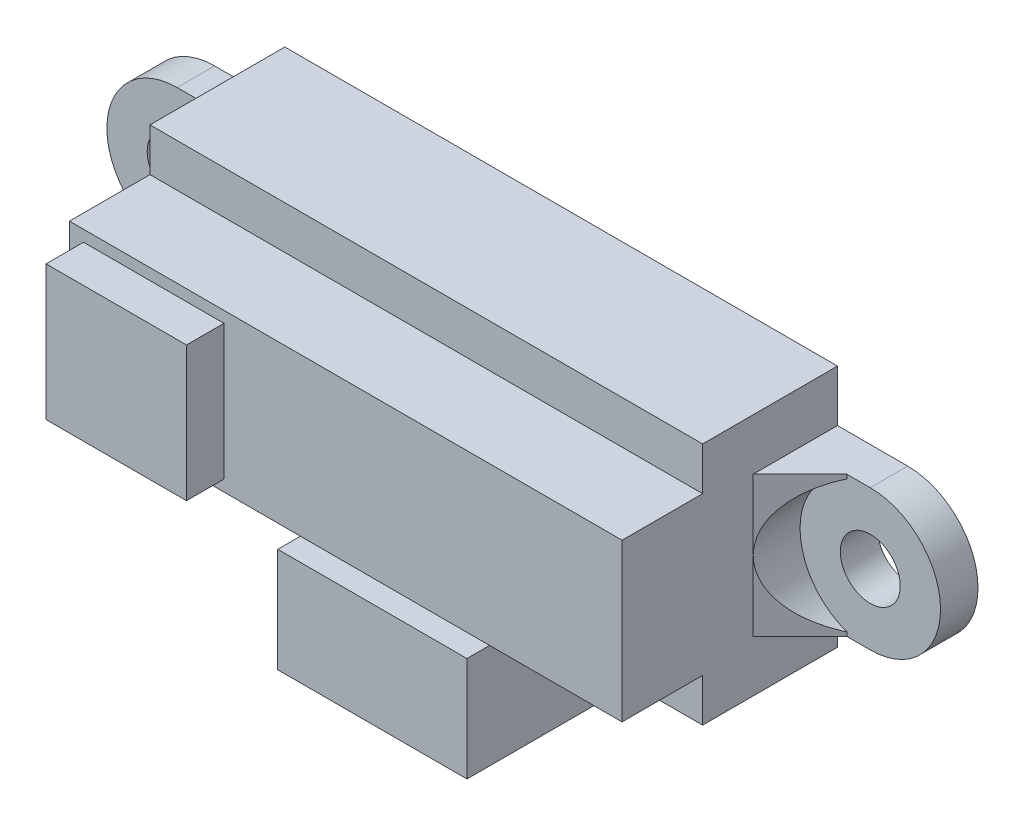
ISO-10303-21;
HEADER;
FILE_DESCRIPTION(('STEP AP214'),'2;1');
FILE_NAME('part.step','',(''),(''),'','','');
FILE_SCHEMA(('AUTOMOTIVE_DESIGN { 1 0 10303 214 1 1 1 1 }'));
ENDSEC;
DATA;
#1=APPLICATION_CONTEXT('core data for automotive mechanical design processes');
#2=APPLICATION_PROTOCOL_DEFINITION('international standard','automotive_design',2000,#1);
#3=PRODUCT_CONTEXT('',#1,'mechanical');
#4=PRODUCT('Part','Part','',(#3));
#5=PRODUCT_RELATED_PRODUCT_CATEGORY('part','',(#4));
#6=PRODUCT_DEFINITION_FORMATION('','',#4);
#7=PRODUCT_DEFINITION_CONTEXT('part definition',#1,'design');
#8=PRODUCT_DEFINITION('design','',#6,#7);
#9=PRODUCT_DEFINITION_SHAPE('','',#8);
#10=(LENGTH_UNIT() NAMED_UNIT(*) SI_UNIT(.MILLI.,.METRE.));
#11=(NAMED_UNIT(*) PLANE_ANGLE_UNIT() SI_UNIT($,.RADIAN.));
#12=(NAMED_UNIT(*) SI_UNIT($,.STERADIAN.) SOLID_ANGLE_UNIT());
#13=UNCERTAINTY_MEASURE_WITH_UNIT(LENGTH_MEASURE(1.E-05),#10,'distance_accuracy_value','');
#14=(GEOMETRIC_REPRESENTATION_CONTEXT(3) GLOBAL_UNCERTAINTY_ASSIGNED_CONTEXT((#13)) GLOBAL_UNIT_ASSIGNED_CONTEXT((#10,
#11,#12)) REPRESENTATION_CONTEXT('',''));
#15=CARTESIAN_POINT('',(0.,0.,0.));
#16=DIRECTION('',(0.,0.,1.));
#17=DIRECTION('',(1.,0.,0.));
#18=AXIS2_PLACEMENT_3D('',#15,#16,#17);
#19=CARTESIAN_POINT('',(14.75,-7.28553390593274,4.5));
#20=DIRECTION('',(0.707106781186548,0.,0.707106781186547));
#21=DIRECTION('',(0.707106781186547,0.,-0.707106781186548));
#22=AXIS2_PLACEMENT_3D('',#19,#20,#21);
#23=PLANE('',#22);
#24=CARTESIAN_POINT('',(18.5,0.,0.749999999999997));
#25=DIRECTION('',(0.707106781186548,0.,0.707106781186547));
#26=DIRECTION('',(-0.707106781186547,0.,0.707106781186548));
#27=AXIS2_PLACEMENT_3D('',#24,#25,#26);
#28=ELLIPSE('',#27,5.30330085889911,3.75);
#29=CARTESIAN_POINT('',(14.75,0.,4.5));
#30=VERTEX_POINT('',#29);
#31=CARTESIAN_POINT('',(17.25,-3.53553390593274,2.));
#32=VERTEX_POINT('',#31);
#33=EDGE_CURVE('E11',#30,#32,#28,.T.);
#34=ORIENTED_EDGE('',*,*,#33,.F.);
#35=DIRECTION('',(0.,1.,0.));
#36=VECTOR('',#35,1.);
#37=CARTESIAN_POINT('',(14.75,-7.28553390593274,4.5));
#38=LINE('',#37,#36);
#39=CARTESIAN_POINT('',(14.75,-3.75,4.5));
#40=VERTEX_POINT('',#39);
#41=EDGE_CURVE('E279',#40,#30,#38,.T.);
#42=ORIENTED_EDGE('',*,*,#41,.F.);
#43=DIRECTION('',(0.707106781186547,0.,-0.707106781186548));
#44=VECTOR('',#43,1.);
#45=CARTESIAN_POINT('',(14.75,-3.75,4.5));
#46=LINE('',#45,#44);
#47=CARTESIAN_POINT('',(17.25,-3.75,2.));
#48=VERTEX_POINT('',#47);
#49=EDGE_CURVE('E275',#40,#48,#46,.T.);
#50=ORIENTED_EDGE('',*,*,#49,.T.);
#51=DIRECTION('',(0.,1.,0.));
#52=VECTOR('',#51,1.);
#53=CARTESIAN_POINT('',(17.25,-7.28553390593274,2.));
#54=LINE('',#53,#52);
#55=EDGE_CURVE('E280',#48,#32,#54,.T.);
#56=ORIENTED_EDGE('',*,*,#55,.T.);
#57=EDGE_LOOP('',(#34,#42,#50,#56));
#58=FACE_BOUND('',#57,.T.);
#59=ADVANCED_FACE('F38',(#58),#23,.T.);
#60=CARTESIAN_POINT('',(-14.75,-7.28553390593274,4.5));
#61=DIRECTION('',(-0.707106781186548,0.,0.707106781186547));
#62=DIRECTION('',(0.707106781186547,0.,0.707106781186548));
#63=AXIS2_PLACEMENT_3D('',#60,#61,#62);
#64=PLANE('',#63);
#65=CARTESIAN_POINT('',(-18.5,0.,0.749999999999997));
#66=DIRECTION('',(-0.707106781186548,0.,0.707106781186547));
#67=DIRECTION('',(0.707106781186547,0.,0.707106781186548));
#68=AXIS2_PLACEMENT_3D('',#65,#66,#67);
#69=ELLIPSE('',#68,5.30330085889911,3.75);
#70=CARTESIAN_POINT('',(-14.75,0.,4.5));
#71=VERTEX_POINT('',#70);
#72=CARTESIAN_POINT('',(-17.25,3.53553390593274,2.));
#73=VERTEX_POINT('',#72);
#74=EDGE_CURVE('E244',#71,#73,#69,.T.);
#75=ORIENTED_EDGE('',*,*,#74,.F.);
#76=DIRECTION('',(0.,1.,0.));
#77=VECTOR('',#76,1.);
#78=CARTESIAN_POINT('',(-14.75,-7.28553390593274,4.5));
#79=LINE('',#78,#77);
#80=CARTESIAN_POINT('',(-14.75,3.75,4.5));
#81=VERTEX_POINT('',#80);
#82=EDGE_CURVE('E268',#71,#81,#79,.T.);
#83=ORIENTED_EDGE('',*,*,#82,.T.);
#84=DIRECTION('',(0.707106781186547,0.,0.707106781186548));
#85=VECTOR('',#84,1.);
#86=CARTESIAN_POINT('',(-14.75,3.75,4.5));
#87=LINE('',#86,#85);
#88=CARTESIAN_POINT('',(-17.25,3.75,2.));
#89=VERTEX_POINT('',#88);
#90=EDGE_CURVE('E263',#89,#81,#87,.T.);
#91=ORIENTED_EDGE('',*,*,#90,.F.);
#92=DIRECTION('',(0.,1.,0.));
#93=VECTOR('',#92,1.);
#94=CARTESIAN_POINT('',(-17.25,-7.28553390593274,2.));
#95=LINE('',#94,#93);
#96=EDGE_CURVE('E255',#73,#89,#95,.T.);
#97=ORIENTED_EDGE('',*,*,#96,.F.);
#98=EDGE_LOOP('',(#75,#83,#91,#97));
#99=FACE_BOUND('',#98,.T.);
#100=ADVANCED_FACE('F261',(#99),#64,.T.);
#101=CARTESIAN_POINT('',(-14.75,-6.5,0.));
#102=DIRECTION('',(0.,-1.,0.));
#103=DIRECTION('',(0.,0.,-1.));
#104=AXIS2_PLACEMENT_3D('',#101,#102,#103);
#105=PLANE('',#104);
#106=DIRECTION('',(1.,0.,0.));
#107=VECTOR('',#106,1.);
#108=CARTESIAN_POINT('',(-5.05,-6.5,3.3));
#109=LINE('',#108,#107);
#110=CARTESIAN_POINT('',(-5.05,-6.5,3.3));
#111=VERTEX_POINT('',#110);
#112=CARTESIAN_POINT('',(5.05,-6.5,3.3));
#113=VERTEX_POINT('',#112);
#114=EDGE_CURVE('E330',#111,#113,#109,.T.);
#115=ORIENTED_EDGE('',*,*,#114,.F.);
#116=DIRECTION('',(0.,0.,1.));
#117=VECTOR('',#116,1.);
#118=CARTESIAN_POINT('',(-5.05,-6.5,3.3));
#119=LINE('',#118,#117);
#120=CARTESIAN_POINT('',(-5.05,-6.5,7.2));
#121=VERTEX_POINT('',#120);
#122=EDGE_CURVE('E319',#111,#121,#119,.T.);
#123=ORIENTED_EDGE('',*,*,#122,.T.);
#124=DIRECTION('',(1.,0.,0.));
#125=VECTOR('',#124,1.);
#126=CARTESIAN_POINT('',(-14.75,-6.5,7.2));
#127=LINE('',#126,#125);
#128=CARTESIAN_POINT('',(-14.75,-6.5,7.2));
#129=VERTEX_POINT('',#128);
#130=EDGE_CURVE('E467',#129,#121,#127,.T.);
#131=ORIENTED_EDGE('',*,*,#130,.F.);
#132=DIRECTION('',(0.,0.,1.));
#133=VECTOR('',#132,1.);
#134=CARTESIAN_POINT('',(-14.75,-6.5,0.));
#135=LINE('',#134,#133);
#136=CARTESIAN_POINT('',(-14.75,-6.5,0.));
#137=VERTEX_POINT('',#136);
#138=EDGE_CURVE('E494',#137,#129,#135,.T.);
#139=ORIENTED_EDGE('',*,*,#138,.F.);
#140=DIRECTION('',(1.,0.,0.));
#141=VECTOR('',#140,1.);
#142=CARTESIAN_POINT('',(-14.75,-6.5,0.));
#143=LINE('',#142,#141);
#144=CARTESIAN_POINT('',(14.75,-6.5,0.));
#145=VERTEX_POINT('',#144);
#146=EDGE_CURVE('E478',#137,#145,#143,.T.);
#147=ORIENTED_EDGE('',*,*,#146,.T.);
#148=DIRECTION('',(0.,0.,1.));
#149=VECTOR('',#148,1.);
#150=CARTESIAN_POINT('',(14.75,-6.5,0.));
#151=LINE('',#150,#149);
#152=CARTESIAN_POINT('',(14.75,-6.5,7.2));
#153=VERTEX_POINT('',#152);
#154=EDGE_CURVE('E491',#145,#153,#151,.T.);
#155=ORIENTED_EDGE('',*,*,#154,.T.);
#156=CARTESIAN_POINT('',(5.05,-6.5,7.2));
#157=VERTEX_POINT('',#156);
#158=EDGE_CURVE('E457',#157,#153,#127,.T.);
#159=ORIENTED_EDGE('',*,*,#158,.F.);
#160=DIRECTION('',(0.,0.,1.));
#161=VECTOR('',#160,1.);
#162=CARTESIAN_POINT('',(5.05,-6.5,3.3));
#163=LINE('',#162,#161);
#164=EDGE_CURVE('E300',#113,#157,#163,.T.);
#165=ORIENTED_EDGE('',*,*,#164,.F.);
#166=EDGE_LOOP('',(#115,#123,#131,#139,#147,#155,#159,#165));
#167=FACE_BOUND('',#166,.T.);
#168=ADVANCED_FACE('F563',(#167),#105,.T.);
#169=CARTESIAN_POINT('',(-14.75,-6.5,7.2));
#170=DIRECTION('',(0.,0.,-1.));
#171=DIRECTION('',(-1.,0.,0.));
#172=AXIS2_PLACEMENT_3D('',#169,#170,#171);
#173=PLANE('',#172);
#174=DIRECTION('',(0.,1.,0.));
#175=VECTOR('',#174,1.);
#176=CARTESIAN_POINT('',(-5.05,-6.5,7.2));
#177=LINE('',#176,#175);
#178=CARTESIAN_POINT('',(-5.05,-5.96466769388865,7.2));
#179=VERTEX_POINT('',#178);
#180=EDGE_CURVE('E322',#121,#179,#177,.T.);
#181=ORIENTED_EDGE('',*,*,#180,.T.);
#182=DIRECTION('',(1.,0.,0.));
#183=VECTOR('',#182,1.);
#184=CARTESIAN_POINT('',(-5.05,-5.96466769388865,7.2));
#185=LINE('',#184,#183);
#186=CARTESIAN_POINT('',(5.05,-5.96466769388865,7.2));
#187=VERTEX_POINT('',#186);
#188=EDGE_CURVE('E326',#179,#187,#185,.T.);
#189=ORIENTED_EDGE('',*,*,#188,.T.);
#190=DIRECTION('',(0.,1.,0.));
#191=VECTOR('',#190,1.);
#192=CARTESIAN_POINT('',(5.05,-6.5,7.2));
#193=LINE('',#192,#191);
#194=EDGE_CURVE('E302',#157,#187,#193,.T.);
#195=ORIENTED_EDGE('',*,*,#194,.F.);
#196=ORIENTED_EDGE('',*,*,#158,.T.);
#197=DIRECTION('',(0.,1.,0.));
#198=VECTOR('',#197,1.);
#199=CARTESIAN_POINT('',(14.75,-6.5,7.2));
#200=LINE('',#199,#198);
#201=CARTESIAN_POINT('',(14.75,-4.2,7.2));
#202=VERTEX_POINT('',#201);
#203=EDGE_CURVE('E445',#153,#202,#200,.T.);
#204=ORIENTED_EDGE('',*,*,#203,.T.);
#205=DIRECTION('',(1.,0.,0.));
#206=VECTOR('',#205,1.);
#207=CARTESIAN_POINT('',(-14.75,-4.2,7.2));
#208=LINE('',#207,#206);
#209=CARTESIAN_POINT('',(-14.75,-4.2,7.2));
#210=VERTEX_POINT('',#209);
#211=EDGE_CURVE('E465',#210,#202,#208,.T.);
#212=ORIENTED_EDGE('',*,*,#211,.F.);
#213=DIRECTION('',(0.,1.,0.));
#214=VECTOR('',#213,1.);
#215=CARTESIAN_POINT('',(-14.75,-6.5,7.2));
#216=LINE('',#215,#214);
#217=EDGE_CURVE('E450',#129,#210,#216,.T.);
#218=ORIENTED_EDGE('',*,*,#217,.F.);
#219=ORIENTED_EDGE('',*,*,#130,.T.);
#220=EDGE_LOOP('',(#181,#189,#195,#196,#204,#212,#218,#219));
#221=FACE_BOUND('',#220,.T.);
#222=ADVANCED_FACE('F659',(#221),#173,.F.);
#223=CARTESIAN_POINT('',(0.,0.,11.5));
#224=DIRECTION('',(0.,0.,1.));
#225=DIRECTION('',(1.,0.,0.));
#226=AXIS2_PLACEMENT_3D('',#223,#224,#225);
#227=PLANE('',#226);
#228=DIRECTION('',(1.,0.,0.));
#229=VECTOR('',#228,1.);
#230=CARTESIAN_POINT('',(-14.75,4.2,11.5));
#231=LINE('',#230,#229);
#232=CARTESIAN_POINT('',(-14.75,4.2,11.5));
#233=VERTEX_POINT('',#232);
#234=CARTESIAN_POINT('',(14.75,4.2,11.5));
#235=VERTEX_POINT('',#234);
#236=EDGE_CURVE('E438',#233,#235,#231,.T.);
#237=ORIENTED_EDGE('',*,*,#236,.F.);
#238=DIRECTION('',(0.,-1.,0.));
#239=VECTOR('',#238,1.);
#240=CARTESIAN_POINT('',(-14.75,6.5,11.5));
#241=LINE('',#240,#239);
#242=CARTESIAN_POINT('',(-14.75,-4.2,11.5));
#243=VERTEX_POINT('',#242);
#244=EDGE_CURVE('E464',#233,#243,#241,.T.);
#245=ORIENTED_EDGE('',*,*,#244,.T.);
#246=DIRECTION('',(1.,0.,0.));
#247=VECTOR('',#246,1.);
#248=CARTESIAN_POINT('',(-14.75,-4.2,11.5));
#249=LINE('',#248,#247);
#250=CARTESIAN_POINT('',(14.75,-4.2,11.5));
#251=VERTEX_POINT('',#250);
#252=EDGE_CURVE('E461',#243,#251,#249,.T.);
#253=ORIENTED_EDGE('',*,*,#252,.T.);
#254=DIRECTION('',(0.,1.,0.));
#255=VECTOR('',#254,1.);
#256=CARTESIAN_POINT('',(14.75,-6.5,11.5));
#257=LINE('',#256,#255);
#258=EDGE_CURVE('E474',#251,#235,#257,.T.);
#259=ORIENTED_EDGE('',*,*,#258,.T.);
#260=EDGE_LOOP('',(#237,#245,#253,#259));
#261=FACE_BOUND('',#260,.T.);
#262=DIRECTION('',(1.,0.,0.));
#263=VECTOR('',#262,1.);
#264=CARTESIAN_POINT('',(-6.5,-3.6,11.5));
#265=LINE('',#264,#263);
#266=CARTESIAN_POINT('',(-14.,-3.6,11.5));
#267=VERTEX_POINT('',#266);
#268=CARTESIAN_POINT('',(-6.5,-3.6,11.5));
#269=VERTEX_POINT('',#268);
#270=EDGE_CURVE('E364',#267,#269,#265,.T.);
#271=ORIENTED_EDGE('',*,*,#270,.F.);
#272=DIRECTION('',(0.,-1.,0.));
#273=VECTOR('',#272,1.);
#274=CARTESIAN_POINT('',(-14.,-3.6,11.5));
#275=LINE('',#274,#273);
#276=CARTESIAN_POINT('',(-14.,3.6,11.5));
#277=VERTEX_POINT('',#276);
#278=EDGE_CURVE('E350',#277,#267,#275,.T.);
#279=ORIENTED_EDGE('',*,*,#278,.F.);
#280=DIRECTION('',(-1.,0.,0.));
#281=VECTOR('',#280,1.);
#282=CARTESIAN_POINT('',(-14.,3.6,11.5));
#283=LINE('',#282,#281);
#284=CARTESIAN_POINT('',(-6.5,3.6,11.5));
#285=VERTEX_POINT('',#284);
#286=EDGE_CURVE('E355',#285,#277,#283,.T.);
#287=ORIENTED_EDGE('',*,*,#286,.F.);
#288=DIRECTION('',(0.,1.,0.));
#289=VECTOR('',#288,1.);
#290=CARTESIAN_POINT('',(-6.5,3.6,11.5));
#291=LINE('',#290,#289);
#292=EDGE_CURVE('E366',#269,#285,#291,.T.);
#293=ORIENTED_EDGE('',*,*,#292,.F.);
#294=EDGE_LOOP('',(#271,#279,#287,#293));
#295=FACE_BOUND('',#294,.T.);
#296=ADVANCED_FACE('F662',(#261,#295),#227,.T.);
#297=CARTESIAN_POINT('',(14.75,6.5,0.));
#298=DIRECTION('',(0.,1.,0.));
#299=DIRECTION('',(0.,0.,1.));
#300=AXIS2_PLACEMENT_3D('',#297,#298,#299);
#301=PLANE('',#300);
#302=DIRECTION('',(1.,0.,0.));
#303=VECTOR('',#302,1.);
#304=CARTESIAN_POINT('',(-14.75,6.5,7.2));
#305=LINE('',#304,#303);
#306=CARTESIAN_POINT('',(-14.75,6.5,7.2));
#307=VERTEX_POINT('',#306);
#308=CARTESIAN_POINT('',(14.75,6.5,7.2));
#309=VERTEX_POINT('',#308);
#310=EDGE_CURVE('E442',#307,#309,#305,.T.);
#311=ORIENTED_EDGE('',*,*,#310,.T.);
#312=DIRECTION('',(0.,0.,1.));
#313=VECTOR('',#312,1.);
#314=CARTESIAN_POINT('',(14.75,6.5,0.));
#315=LINE('',#314,#313);
#316=CARTESIAN_POINT('',(14.75,6.5,0.));
#317=VERTEX_POINT('',#316);
#318=EDGE_CURVE('E488',#317,#309,#315,.T.);
#319=ORIENTED_EDGE('',*,*,#318,.F.);
#320=DIRECTION('',(-1.,0.,0.));
#321=VECTOR('',#320,1.);
#322=CARTESIAN_POINT('',(14.75,6.5,0.));
#323=LINE('',#322,#321);
#324=CARTESIAN_POINT('',(-14.75,6.5,0.));
#325=VERTEX_POINT('',#324);
#326=EDGE_CURVE('E470',#317,#325,#323,.T.);
#327=ORIENTED_EDGE('',*,*,#326,.T.);
#328=DIRECTION('',(0.,0.,1.));
#329=VECTOR('',#328,1.);
#330=CARTESIAN_POINT('',(-14.75,6.5,0.));
#331=LINE('',#330,#329);
#332=EDGE_CURVE('E485',#325,#307,#331,.T.);
#333=ORIENTED_EDGE('',*,*,#332,.T.);
#334=EDGE_LOOP('',(#311,#319,#327,#333));
#335=FACE_BOUND('',#334,.T.);
#336=ADVANCED_FACE('F40',(#335),#301,.T.);
#337=CARTESIAN_POINT('',(14.75,-6.5,0.));
#338=DIRECTION('',(1.,0.,0.));
#339=DIRECTION('',(0.,0.,-1.));
#340=AXIS2_PLACEMENT_3D('',#337,#338,#339);
#341=PLANE('',#340);
#342=DIRECTION('',(0.,0.,-1.));
#343=VECTOR('',#342,1.);
#344=CARTESIAN_POINT('',(14.75,4.2,11.5));
#345=LINE('',#344,#343);
#346=CARTESIAN_POINT('',(14.75,4.2,7.2));
#347=VERTEX_POINT('',#346);
#348=EDGE_CURVE('E424',#235,#347,#345,.T.);
#349=ORIENTED_EDGE('',*,*,#348,.F.);
#350=ORIENTED_EDGE('',*,*,#258,.F.);
#351=DIRECTION('',(0.,0.,1.));
#352=VECTOR('',#351,1.);
#353=CARTESIAN_POINT('',(14.75,-4.2,7.2));
#354=LINE('',#353,#352);
#355=EDGE_CURVE('E454',#202,#251,#354,.T.);
#356=ORIENTED_EDGE('',*,*,#355,.F.);
#357=ORIENTED_EDGE('',*,*,#203,.F.);
#358=ORIENTED_EDGE('',*,*,#154,.F.);
#359=DIRECTION('',(0.,1.,0.));
#360=VECTOR('',#359,1.);
#361=CARTESIAN_POINT('',(14.75,-6.5,0.));
#362=LINE('',#361,#360);
#363=CARTESIAN_POINT('',(14.75,-3.75,0.));
#364=VERTEX_POINT('',#363);
#365=EDGE_CURVE('E482',#145,#364,#362,.T.);
#366=ORIENTED_EDGE('',*,*,#365,.T.);
#367=DIRECTION('',(0.,0.,-1.));
#368=VECTOR('',#367,1.);
#369=CARTESIAN_POINT('',(14.75,-3.75,2.));
#370=LINE('',#369,#368);
#371=EDGE_CURVE('E414',#40,#364,#370,.T.);
#372=ORIENTED_EDGE('',*,*,#371,.F.);
#373=ORIENTED_EDGE('',*,*,#41,.T.);
#374=CARTESIAN_POINT('',(14.75,3.75,4.5));
#375=VERTEX_POINT('',#374);
#376=EDGE_CURVE('E274',#30,#375,#38,.T.);
#377=ORIENTED_EDGE('',*,*,#376,.T.);
#378=DIRECTION('',(0.,0.,-1.));
#379=VECTOR('',#378,1.);
#380=CARTESIAN_POINT('',(14.75,3.75,2.));
#381=LINE('',#380,#379);
#382=CARTESIAN_POINT('',(14.75,3.75,0.));
#383=VERTEX_POINT('',#382);
#384=EDGE_CURVE('E427',#375,#383,#381,.T.);
#385=ORIENTED_EDGE('',*,*,#384,.T.);
#386=EDGE_CURVE('E481',#383,#317,#362,.T.);
#387=ORIENTED_EDGE('',*,*,#386,.T.);
#388=ORIENTED_EDGE('',*,*,#318,.T.);
#389=DIRECTION('',(0.,1.,0.));
#390=VECTOR('',#389,1.);
#391=CARTESIAN_POINT('',(14.75,4.2,7.2));
#392=LINE('',#391,#390);
#393=EDGE_CURVE('E435',#347,#309,#392,.T.);
#394=ORIENTED_EDGE('',*,*,#393,.F.);
#395=EDGE_LOOP('',(#349,#350,#356,#357,#358,#366,#372,#373,#377,#385,#387,#388,#394));
#396=FACE_BOUND('',#395,.T.);
#397=ADVANCED_FACE('F546',(#396),#341,.T.);
#398=CARTESIAN_POINT('',(-14.75,6.5,0.));
#399=DIRECTION('',(-1.,0.,0.));
#400=DIRECTION('',(0.,0.,1.));
#401=AXIS2_PLACEMENT_3D('',#398,#399,#400);
#402=PLANE('',#401);
#403=DIRECTION('',(0.,0.,1.));
#404=VECTOR('',#403,1.);
#405=CARTESIAN_POINT('',(-14.75,-4.2,7.2));
#406=LINE('',#405,#404);
#407=EDGE_CURVE('E453',#210,#243,#406,.T.);
#408=ORIENTED_EDGE('',*,*,#407,.T.);
#409=ORIENTED_EDGE('',*,*,#244,.F.);
#410=DIRECTION('',(0.,0.,-1.));
#411=VECTOR('',#410,1.);
#412=CARTESIAN_POINT('',(-14.75,4.2,11.5));
#413=LINE('',#412,#411);
#414=CARTESIAN_POINT('',(-14.75,4.2,7.2));
#415=VERTEX_POINT('',#414);
#416=EDGE_CURVE('E431',#233,#415,#413,.T.);
#417=ORIENTED_EDGE('',*,*,#416,.T.);
#418=DIRECTION('',(0.,1.,0.));
#419=VECTOR('',#418,1.);
#420=CARTESIAN_POINT('',(-14.75,4.2,7.2));
#421=LINE('',#420,#419);
#422=EDGE_CURVE('E434',#415,#307,#421,.T.);
#423=ORIENTED_EDGE('',*,*,#422,.T.);
#424=ORIENTED_EDGE('',*,*,#332,.F.);
#425=DIRECTION('',(0.,-1.,0.));
#426=VECTOR('',#425,1.);
#427=CARTESIAN_POINT('',(-14.75,6.5,0.));
#428=LINE('',#427,#426);
#429=CARTESIAN_POINT('',(-14.75,3.75,0.));
#430=VERTEX_POINT('',#429);
#431=EDGE_CURVE('E475',#325,#430,#428,.T.);
#432=ORIENTED_EDGE('',*,*,#431,.T.);
#433=DIRECTION('',(0.,0.,-1.));
#434=VECTOR('',#433,1.);
#435=CARTESIAN_POINT('',(-14.75,3.75,2.));
#436=LINE('',#435,#434);
#437=EDGE_CURVE('E402',#81,#430,#436,.T.);
#438=ORIENTED_EDGE('',*,*,#437,.F.);
#439=ORIENTED_EDGE('',*,*,#82,.F.);
#440=CARTESIAN_POINT('',(-14.75,-3.75,4.5));
#441=VERTEX_POINT('',#440);
#442=EDGE_CURVE('E264',#441,#71,#79,.T.);
#443=ORIENTED_EDGE('',*,*,#442,.F.);
#444=DIRECTION('',(0.,0.,-1.));
#445=VECTOR('',#444,1.);
#446=CARTESIAN_POINT('',(-14.75,-3.75,2.));
#447=LINE('',#446,#445);
#448=CARTESIAN_POINT('',(-14.75,-3.75,0.));
#449=VERTEX_POINT('',#448);
#450=EDGE_CURVE('E399',#441,#449,#447,.T.);
#451=ORIENTED_EDGE('',*,*,#450,.T.);
#452=EDGE_CURVE('E473',#449,#137,#428,.T.);
#453=ORIENTED_EDGE('',*,*,#452,.T.);
#454=ORIENTED_EDGE('',*,*,#138,.T.);
#455=ORIENTED_EDGE('',*,*,#217,.T.);
#456=EDGE_LOOP('',(#408,#409,#417,#423,#424,#432,#438,#439,#443,#451,#453,#454,#455));
#457=FACE_BOUND('',#456,.T.);
#458=ADVANCED_FACE('F503',(#457),#402,.T.);
#459=CARTESIAN_POINT('',(0.,0.,0.));
#460=DIRECTION('',(0.,0.,1.));
#461=DIRECTION('',(1.,0.,0.));
#462=AXIS2_PLACEMENT_3D('',#459,#460,#461);
#463=PLANE('',#462);
#464=CARTESIAN_POINT('',(18.5,0.,0.));
#465=DIRECTION('',(0.,0.,-1.));
#466=DIRECTION('',(-1.,0.,0.));
#467=AXIS2_PLACEMENT_3D('',#464,#465,#466);
#468=CIRCLE('',#467,1.59999999999999);
#469=CARTESIAN_POINT('',(16.9,0.,0.));
#470=VERTEX_POINT('',#469);
#471=EDGE_CURVE('E329',#470,#470,#468,.T.);
#472=ORIENTED_EDGE('',*,*,#471,.F.);
#473=EDGE_LOOP('',(#472));
#474=FACE_BOUND('',#473,.T.);
#475=CARTESIAN_POINT('',(-18.5,0.,0.));
#476=DIRECTION('',(0.,0.,-1.));
#477=DIRECTION('',(-1.,0.,0.));
#478=AXIS2_PLACEMENT_3D('',#475,#476,#477);
#479=CIRCLE('',#478,1.59999999999999);
#480=CARTESIAN_POINT('',(-20.1,0.,0.));
#481=VERTEX_POINT('',#480);
#482=EDGE_CURVE('E344',#481,#481,#479,.T.);
#483=ORIENTED_EDGE('',*,*,#482,.F.);
#484=EDGE_LOOP('',(#483));
#485=FACE_BOUND('',#484,.T.);
#486=ORIENTED_EDGE('',*,*,#326,.F.);
#487=ORIENTED_EDGE('',*,*,#386,.F.);
#488=DIRECTION('',(1.,0.,0.));
#489=VECTOR('',#488,1.);
#490=CARTESIAN_POINT('',(14.75,3.75,0.));
#491=LINE('',#490,#489);
#492=CARTESIAN_POINT('',(18.5,3.75,0.));
#493=VERTEX_POINT('',#492);
#494=EDGE_CURVE('E417',#383,#493,#491,.T.);
#495=ORIENTED_EDGE('',*,*,#494,.T.);
#496=CARTESIAN_POINT('',(18.5,0.,0.));
#497=DIRECTION('',(0.,0.,-1.));
#498=DIRECTION('',(-1.,0.,0.));
#499=AXIS2_PLACEMENT_3D('',#496,#497,#498);
#500=CIRCLE('',#499,3.75);
#501=CARTESIAN_POINT('',(18.5,-3.75,0.));
#502=VERTEX_POINT('',#501);
#503=EDGE_CURVE('E409',#493,#502,#500,.T.);
#504=ORIENTED_EDGE('',*,*,#503,.T.);
#505=DIRECTION('',(-1.,0.,0.));
#506=VECTOR('',#505,1.);
#507=CARTESIAN_POINT('',(18.5,-3.75,0.));
#508=LINE('',#507,#506);
#509=EDGE_CURVE('E398',#502,#364,#508,.T.);
#510=ORIENTED_EDGE('',*,*,#509,.T.);
#511=ORIENTED_EDGE('',*,*,#365,.F.);
#512=ORIENTED_EDGE('',*,*,#146,.F.);
#513=ORIENTED_EDGE('',*,*,#452,.F.);
#514=DIRECTION('',(-1.,0.,0.));
#515=VECTOR('',#514,1.);
#516=CARTESIAN_POINT('',(-14.75,-3.75,0.));
#517=LINE('',#516,#515);
#518=CARTESIAN_POINT('',(-18.5,-3.75,0.));
#519=VERTEX_POINT('',#518);
#520=EDGE_CURVE('E384',#449,#519,#517,.T.);
#521=ORIENTED_EDGE('',*,*,#520,.T.);
#522=CARTESIAN_POINT('',(-18.5,0.,0.));
#523=DIRECTION('',(0.,0.,-1.));
#524=DIRECTION('',(-1.,0.,0.));
#525=AXIS2_PLACEMENT_3D('',#522,#523,#524);
#526=CIRCLE('',#525,3.75);
#527=CARTESIAN_POINT('',(-18.5,3.75,0.));
#528=VERTEX_POINT('',#527);
#529=EDGE_CURVE('E379',#519,#528,#526,.T.);
#530=ORIENTED_EDGE('',*,*,#529,.T.);
#531=DIRECTION('',(1.,0.,0.));
#532=VECTOR('',#531,1.);
#533=CARTESIAN_POINT('',(-18.5,3.75,0.));
#534=LINE('',#533,#532);
#535=EDGE_CURVE('E391',#528,#430,#534,.T.);
#536=ORIENTED_EDGE('',*,*,#535,.T.);
#537=ORIENTED_EDGE('',*,*,#431,.F.);
#538=EDGE_LOOP('',(#486,#487,#495,#504,#510,#511,#512,#513,#521,#530,#536,#537));
#539=FACE_BOUND('',#538,.T.);
#540=ADVANCED_FACE('F507',(#474,#485,#539),#463,.F.);
#541=CARTESIAN_POINT('',(-14.75,-4.2,7.2));
#542=DIRECTION('',(0.,1.,0.));
#543=DIRECTION('',(0.,0.,1.));
#544=AXIS2_PLACEMENT_3D('',#541,#542,#543);
#545=PLANE('',#544);
#546=ORIENTED_EDGE('',*,*,#355,.T.);
#547=ORIENTED_EDGE('',*,*,#252,.F.);
#548=ORIENTED_EDGE('',*,*,#407,.F.);
#549=ORIENTED_EDGE('',*,*,#211,.T.);
#550=EDGE_LOOP('',(#546,#547,#548,#549));
#551=FACE_BOUND('',#550,.T.);
#552=ADVANCED_FACE('F651',(#551),#545,.F.);
#553=CARTESIAN_POINT('',(-14.75,4.2,7.2));
#554=DIRECTION('',(0.,0.,-1.));
#555=DIRECTION('',(-1.,0.,0.));
#556=AXIS2_PLACEMENT_3D('',#553,#554,#555);
#557=PLANE('',#556);
#558=ORIENTED_EDGE('',*,*,#393,.T.);
#559=ORIENTED_EDGE('',*,*,#310,.F.);
#560=ORIENTED_EDGE('',*,*,#422,.F.);
#561=DIRECTION('',(1.,0.,0.));
#562=VECTOR('',#561,1.);
#563=CARTESIAN_POINT('',(-14.75,4.2,7.2));
#564=LINE('',#563,#562);
#565=EDGE_CURVE('E446',#415,#347,#564,.T.);
#566=ORIENTED_EDGE('',*,*,#565,.T.);
#567=EDGE_LOOP('',(#558,#559,#560,#566));
#568=FACE_BOUND('',#567,.T.);
#569=ADVANCED_FACE('F648',(#568),#557,.F.);
#570=CARTESIAN_POINT('',(-14.75,4.2,11.5));
#571=DIRECTION('',(0.,-1.,0.));
#572=DIRECTION('',(0.,0.,-1.));
#573=AXIS2_PLACEMENT_3D('',#570,#571,#572);
#574=PLANE('',#573);
#575=ORIENTED_EDGE('',*,*,#348,.T.);
#576=ORIENTED_EDGE('',*,*,#565,.F.);
#577=ORIENTED_EDGE('',*,*,#416,.F.);
#578=ORIENTED_EDGE('',*,*,#236,.T.);
#579=EDGE_LOOP('',(#575,#576,#577,#578));
#580=FACE_BOUND('',#579,.T.);
#581=ADVANCED_FACE('F647',(#580),#574,.F.);
#582=CARTESIAN_POINT('',(18.5,-3.75,2.));
#583=DIRECTION('',(0.,-1.,0.));
#584=DIRECTION('',(0.,0.,-1.));
#585=AXIS2_PLACEMENT_3D('',#582,#583,#584);
#586=PLANE('',#585);
#587=ORIENTED_EDGE('',*,*,#509,.F.);
#588=DIRECTION('',(0.,0.,-1.));
#589=VECTOR('',#588,1.);
#590=CARTESIAN_POINT('',(18.5,-3.75,2.));
#591=LINE('',#590,#589);
#592=CARTESIAN_POINT('',(18.5,-3.75,2.));
#593=VERTEX_POINT('',#592);
#594=EDGE_CURVE('E422',#593,#502,#591,.T.);
#595=ORIENTED_EDGE('',*,*,#594,.F.);
#596=DIRECTION('',(-1.,0.,0.));
#597=VECTOR('',#596,1.);
#598=CARTESIAN_POINT('',(18.5,-3.75,2.));
#599=LINE('',#598,#597);
#600=EDGE_CURVE('E405',#593,#48,#599,.T.);
#601=ORIENTED_EDGE('',*,*,#600,.T.);
#602=ORIENTED_EDGE('',*,*,#49,.F.);
#603=ORIENTED_EDGE('',*,*,#371,.T.);
#604=EDGE_LOOP('',(#587,#595,#601,#602,#603));
#605=FACE_BOUND('',#604,.T.);
#606=ADVANCED_FACE('F535',(#605),#586,.T.);
#607=CARTESIAN_POINT('',(18.5,0.,2.));
#608=DIRECTION('',(0.,0.,-1.));
#609=DIRECTION('',(-1.,0.,0.));
#610=AXIS2_PLACEMENT_3D('',#607,#608,#609);
#611=CYLINDRICAL_SURFACE('',#610,3.75);
#612=ORIENTED_EDGE('',*,*,#503,.F.);
#613=DIRECTION('',(0.,0.,-1.));
#614=VECTOR('',#613,1.);
#615=CARTESIAN_POINT('',(18.5,3.75,2.));
#616=LINE('',#615,#614);
#617=CARTESIAN_POINT('',(18.5,3.75,2.));
#618=VERTEX_POINT('',#617);
#619=EDGE_CURVE('E425',#618,#493,#616,.T.);
#620=ORIENTED_EDGE('',*,*,#619,.F.);
#621=CARTESIAN_POINT('',(18.5,0.,2.));
#622=DIRECTION('',(0.,0.,-1.));
#623=DIRECTION('',(-1.,0.,0.));
#624=AXIS2_PLACEMENT_3D('',#621,#622,#623);
#625=CIRCLE('',#624,3.75);
#626=EDGE_CURVE('E411',#618,#593,#625,.T.);
#627=ORIENTED_EDGE('',*,*,#626,.T.);
#628=ORIENTED_EDGE('',*,*,#594,.T.);
#629=EDGE_LOOP('',(#612,#620,#627,#628));
#630=FACE_BOUND('',#629,.T.);
#631=ADVANCED_FACE('F540',(#630),#611,.T.);
#632=CARTESIAN_POINT('',(14.75,3.75,2.));
#633=DIRECTION('',(0.,1.,0.));
#634=DIRECTION('',(0.,0.,1.));
#635=AXIS2_PLACEMENT_3D('',#632,#633,#634);
#636=PLANE('',#635);
#637=ORIENTED_EDGE('',*,*,#494,.F.);
#638=ORIENTED_EDGE('',*,*,#384,.F.);
#639=DIRECTION('',(0.707106781186547,0.,-0.707106781186548));
#640=VECTOR('',#639,1.);
#641=CARTESIAN_POINT('',(14.75,3.75,4.5));
#642=LINE('',#641,#640);
#643=CARTESIAN_POINT('',(17.25,3.75,2.));
#644=VERTEX_POINT('',#643);
#645=EDGE_CURVE('E266',#375,#644,#642,.T.);
#646=ORIENTED_EDGE('',*,*,#645,.T.);
#647=DIRECTION('',(1.,0.,0.));
#648=VECTOR('',#647,1.);
#649=CARTESIAN_POINT('',(14.75,3.75,2.));
#650=LINE('',#649,#648);
#651=EDGE_CURVE('E408',#644,#618,#650,.T.);
#652=ORIENTED_EDGE('',*,*,#651,.T.);
#653=ORIENTED_EDGE('',*,*,#619,.T.);
#654=EDGE_LOOP('',(#637,#638,#646,#652,#653));
#655=FACE_BOUND('',#654,.T.);
#656=ADVANCED_FACE('F542',(#655),#636,.T.);
#657=CARTESIAN_POINT('',(18.5,0.,2.));
#658=DIRECTION('',(0.,0.,-1.));
#659=DIRECTION('',(-1.,0.,0.));
#660=AXIS2_PLACEMENT_3D('',#657,#658,#659);
#661=PLANE('',#660);
#662=ORIENTED_EDGE('',*,*,#600,.F.);
#663=ORIENTED_EDGE('',*,*,#626,.F.);
#664=ORIENTED_EDGE('',*,*,#651,.F.);
#665=CARTESIAN_POINT('',(17.25,3.53553390593274,2.));
#666=VERTEX_POINT('',#665);
#667=EDGE_CURVE('E278',#666,#644,#54,.T.);
#668=ORIENTED_EDGE('',*,*,#667,.F.);
#669=CARTESIAN_POINT('',(18.5,0.,2.));
#670=DIRECTION('',(0.,0.,-1.));
#671=DIRECTION('',(-1.,0.,0.));
#672=AXIS2_PLACEMENT_3D('',#669,#670,#671);
#673=CIRCLE('',#672,3.75);
#674=EDGE_CURVE('E52',#666,#32,#673,.F.);
#675=ORIENTED_EDGE('',*,*,#674,.T.);
#676=ORIENTED_EDGE('',*,*,#55,.F.);
#677=EDGE_LOOP('',(#662,#663,#664,#668,#675,#676));
#678=FACE_BOUND('',#677,.T.);
#679=CARTESIAN_POINT('',(18.5,0.,2.));
#680=DIRECTION('',(0.,0.,-1.));
#681=DIRECTION('',(-1.,0.,0.));
#682=AXIS2_PLACEMENT_3D('',#679,#680,#681);
#683=CIRCLE('',#682,1.59999999999999);
#684=CARTESIAN_POINT('',(16.9,0.,2.));
#685=VERTEX_POINT('',#684);
#686=EDGE_CURVE('E341',#685,#685,#683,.T.);
#687=ORIENTED_EDGE('',*,*,#686,.T.);
#688=EDGE_LOOP('',(#687));
#689=FACE_BOUND('',#688,.T.);
#690=ADVANCED_FACE('F525',(#678,#689),#661,.F.);
#691=CARTESIAN_POINT('',(-18.5,0.,2.));
#692=DIRECTION('',(0.,0.,-1.));
#693=DIRECTION('',(-1.,0.,0.));
#694=AXIS2_PLACEMENT_3D('',#691,#692,#693);
#695=CYLINDRICAL_SURFACE('',#694,3.75);
#696=ORIENTED_EDGE('',*,*,#529,.F.);
#697=DIRECTION('',(0.,0.,-1.));
#698=VECTOR('',#697,1.);
#699=CARTESIAN_POINT('',(-18.5,-3.75,2.));
#700=LINE('',#699,#698);
#701=CARTESIAN_POINT('',(-18.5,-3.75,2.));
#702=VERTEX_POINT('',#701);
#703=EDGE_CURVE('E396',#702,#519,#700,.T.);
#704=ORIENTED_EDGE('',*,*,#703,.F.);
#705=CARTESIAN_POINT('',(-18.5,0.,2.));
#706=DIRECTION('',(0.,0.,-1.));
#707=DIRECTION('',(-1.,0.,0.));
#708=AXIS2_PLACEMENT_3D('',#705,#706,#707);
#709=CIRCLE('',#708,3.75);
#710=CARTESIAN_POINT('',(-18.5,3.75,2.));
#711=VERTEX_POINT('',#710);
#712=EDGE_CURVE('E380',#702,#711,#709,.T.);
#713=ORIENTED_EDGE('',*,*,#712,.T.);
#714=DIRECTION('',(0.,0.,-1.));
#715=VECTOR('',#714,1.);
#716=CARTESIAN_POINT('',(-18.5,3.75,2.));
#717=LINE('',#716,#715);
#718=EDGE_CURVE('E388',#711,#528,#717,.T.);
#719=ORIENTED_EDGE('',*,*,#718,.T.);
#720=EDGE_LOOP('',(#696,#704,#713,#719));
#721=FACE_BOUND('',#720,.T.);
#722=ADVANCED_FACE('F633',(#721),#695,.T.);
#723=CARTESIAN_POINT('',(-14.75,-3.75,2.));
#724=DIRECTION('',(0.,-1.,0.));
#725=DIRECTION('',(0.,0.,-1.));
#726=AXIS2_PLACEMENT_3D('',#723,#724,#725);
#727=PLANE('',#726);
#728=ORIENTED_EDGE('',*,*,#520,.F.);
#729=ORIENTED_EDGE('',*,*,#450,.F.);
#730=DIRECTION('',(0.707106781186547,0.,0.707106781186548));
#731=VECTOR('',#730,1.);
#732=CARTESIAN_POINT('',(-14.75,-3.75,4.5));
#733=LINE('',#732,#731);
#734=CARTESIAN_POINT('',(-17.25,-3.75,2.));
#735=VERTEX_POINT('',#734);
#736=EDGE_CURVE('E515',#735,#441,#733,.T.);
#737=ORIENTED_EDGE('',*,*,#736,.F.);
#738=DIRECTION('',(-1.,0.,0.));
#739=VECTOR('',#738,1.);
#740=CARTESIAN_POINT('',(-14.75,-3.75,2.));
#741=LINE('',#740,#739);
#742=EDGE_CURVE('E386',#735,#702,#741,.T.);
#743=ORIENTED_EDGE('',*,*,#742,.T.);
#744=ORIENTED_EDGE('',*,*,#703,.T.);
#745=EDGE_LOOP('',(#728,#729,#737,#743,#744));
#746=FACE_BOUND('',#745,.T.);
#747=ADVANCED_FACE('F630',(#746),#727,.T.);
#748=CARTESIAN_POINT('',(-18.5,3.75,2.));
#749=DIRECTION('',(0.,1.,0.));
#750=DIRECTION('',(0.,0.,1.));
#751=AXIS2_PLACEMENT_3D('',#748,#749,#750);
#752=PLANE('',#751);
#753=ORIENTED_EDGE('',*,*,#535,.F.);
#754=ORIENTED_EDGE('',*,*,#718,.F.);
#755=DIRECTION('',(1.,0.,0.));
#756=VECTOR('',#755,1.);
#757=CARTESIAN_POINT('',(-18.5,3.75,2.));
#758=LINE('',#757,#756);
#759=EDGE_CURVE('E383',#711,#89,#758,.T.);
#760=ORIENTED_EDGE('',*,*,#759,.T.);
#761=ORIENTED_EDGE('',*,*,#90,.T.);
#762=ORIENTED_EDGE('',*,*,#437,.T.);
#763=EDGE_LOOP('',(#753,#754,#760,#761,#762));
#764=FACE_BOUND('',#763,.T.);
#765=ADVANCED_FACE('F512',(#764),#752,.T.);
#766=CARTESIAN_POINT('',(-18.5,0.,2.));
#767=DIRECTION('',(0.,0.,-1.));
#768=DIRECTION('',(-1.,0.,0.));
#769=AXIS2_PLACEMENT_3D('',#766,#767,#768);
#770=PLANE('',#769);
#771=CARTESIAN_POINT('',(-17.25,-3.53553390593274,2.));
#772=VERTEX_POINT('',#771);
#773=EDGE_CURVE('E258',#735,#772,#95,.T.);
#774=ORIENTED_EDGE('',*,*,#773,.T.);
#775=CARTESIAN_POINT('',(-18.5,0.,2.));
#776=DIRECTION('',(0.,0.,-1.));
#777=DIRECTION('',(-1.,0.,0.));
#778=AXIS2_PLACEMENT_3D('',#775,#776,#777);
#779=CIRCLE('',#778,3.75);
#780=EDGE_CURVE('E60',#772,#73,#779,.F.);
#781=ORIENTED_EDGE('',*,*,#780,.T.);
#782=ORIENTED_EDGE('',*,*,#96,.T.);
#783=ORIENTED_EDGE('',*,*,#759,.F.);
#784=ORIENTED_EDGE('',*,*,#712,.F.);
#785=ORIENTED_EDGE('',*,*,#742,.F.);
#786=EDGE_LOOP('',(#774,#781,#782,#783,#784,#785));
#787=FACE_BOUND('',#786,.T.);
#788=CARTESIAN_POINT('',(-18.5,0.,2.));
#789=DIRECTION('',(0.,0.,-1.));
#790=DIRECTION('',(-1.,0.,0.));
#791=AXIS2_PLACEMENT_3D('',#788,#789,#790);
#792=CIRCLE('',#791,1.59999999999999);
#793=CARTESIAN_POINT('',(-20.1,0.,2.));
#794=VERTEX_POINT('',#793);
#795=EDGE_CURVE('E347',#794,#794,#792,.T.);
#796=ORIENTED_EDGE('',*,*,#795,.T.);
#797=EDGE_LOOP('',(#796));
#798=FACE_BOUND('',#797,.T.);
#799=ADVANCED_FACE('F252',(#787,#798),#770,.F.);
#800=CARTESIAN_POINT('',(-14.,-3.6,13.5));
#801=DIRECTION('',(1.,0.,0.));
#802=DIRECTION('',(0.,0.,-1.));
#803=AXIS2_PLACEMENT_3D('',#800,#801,#802);
#804=PLANE('',#803);
#805=ORIENTED_EDGE('',*,*,#278,.T.);
#806=DIRECTION('',(0.,0.,-1.));
#807=VECTOR('',#806,1.);
#808=CARTESIAN_POINT('',(-14.,-3.6,13.5));
#809=LINE('',#808,#807);
#810=CARTESIAN_POINT('',(-14.,-3.6,13.5));
#811=VERTEX_POINT('',#810);
#812=EDGE_CURVE('E377',#811,#267,#809,.T.);
#813=ORIENTED_EDGE('',*,*,#812,.F.);
#814=DIRECTION('',(0.,-1.,0.));
#815=VECTOR('',#814,1.);
#816=CARTESIAN_POINT('',(-14.,-3.6,13.5));
#817=LINE('',#816,#815);
#818=CARTESIAN_POINT('',(-14.,3.6,13.5));
#819=VERTEX_POINT('',#818);
#820=EDGE_CURVE('E351',#819,#811,#817,.T.);
#821=ORIENTED_EDGE('',*,*,#820,.F.);
#822=DIRECTION('',(0.,0.,-1.));
#823=VECTOR('',#822,1.);
#824=CARTESIAN_POINT('',(-14.,3.6,13.5));
#825=LINE('',#824,#823);
#826=EDGE_CURVE('E361',#819,#277,#825,.T.);
#827=ORIENTED_EDGE('',*,*,#826,.T.);
#828=EDGE_LOOP('',(#805,#813,#821,#827));
#829=FACE_BOUND('',#828,.T.);
#830=ADVANCED_FACE('F623',(#829),#804,.F.);
#831=CARTESIAN_POINT('',(-6.5,-3.6,13.5));
#832=DIRECTION('',(0.,1.,0.));
#833=DIRECTION('',(0.,0.,1.));
#834=AXIS2_PLACEMENT_3D('',#831,#832,#833);
#835=PLANE('',#834);
#836=ORIENTED_EDGE('',*,*,#270,.T.);
#837=DIRECTION('',(0.,0.,-1.));
#838=VECTOR('',#837,1.);
#839=CARTESIAN_POINT('',(-6.5,-3.6,13.5));
#840=LINE('',#839,#838);
#841=CARTESIAN_POINT('',(-6.5,-3.6,13.5));
#842=VERTEX_POINT('',#841);
#843=EDGE_CURVE('E374',#842,#269,#840,.T.);
#844=ORIENTED_EDGE('',*,*,#843,.F.);
#845=DIRECTION('',(1.,0.,0.));
#846=VECTOR('',#845,1.);
#847=CARTESIAN_POINT('',(-6.5,-3.6,13.5));
#848=LINE('',#847,#846);
#849=EDGE_CURVE('E354',#811,#842,#848,.T.);
#850=ORIENTED_EDGE('',*,*,#849,.F.);
#851=ORIENTED_EDGE('',*,*,#812,.T.);
#852=EDGE_LOOP('',(#836,#844,#850,#851));
#853=FACE_BOUND('',#852,.T.);
#854=ADVANCED_FACE('F619',(#853),#835,.F.);
#855=CARTESIAN_POINT('',(-6.5,3.6,13.5));
#856=DIRECTION('',(-1.,0.,0.));
#857=DIRECTION('',(0.,0.,1.));
#858=AXIS2_PLACEMENT_3D('',#855,#856,#857);
#859=PLANE('',#858);
#860=ORIENTED_EDGE('',*,*,#292,.T.);
#861=DIRECTION('',(0.,0.,-1.));
#862=VECTOR('',#861,1.);
#863=CARTESIAN_POINT('',(-6.5,3.6,13.5));
#864=LINE('',#863,#862);
#865=CARTESIAN_POINT('',(-6.5,3.6,13.5));
#866=VERTEX_POINT('',#865);
#867=EDGE_CURVE('E372',#866,#285,#864,.T.);
#868=ORIENTED_EDGE('',*,*,#867,.F.);
#869=DIRECTION('',(0.,1.,0.));
#870=VECTOR('',#869,1.);
#871=CARTESIAN_POINT('',(-6.5,3.6,13.5));
#872=LINE('',#871,#870);
#873=EDGE_CURVE('E357',#842,#866,#872,.T.);
#874=ORIENTED_EDGE('',*,*,#873,.F.);
#875=ORIENTED_EDGE('',*,*,#843,.T.);
#876=EDGE_LOOP('',(#860,#868,#874,#875));
#877=FACE_BOUND('',#876,.T.);
#878=ADVANCED_FACE('F615',(#877),#859,.F.);
#879=CARTESIAN_POINT('',(-14.,3.6,13.5));
#880=DIRECTION('',(0.,-1.,0.));
#881=DIRECTION('',(0.,0.,-1.));
#882=AXIS2_PLACEMENT_3D('',#879,#880,#881);
#883=PLANE('',#882);
#884=ORIENTED_EDGE('',*,*,#286,.T.);
#885=ORIENTED_EDGE('',*,*,#826,.F.);
#886=DIRECTION('',(-1.,0.,0.));
#887=VECTOR('',#886,1.);
#888=CARTESIAN_POINT('',(-14.,3.6,13.5));
#889=LINE('',#888,#887);
#890=EDGE_CURVE('E359',#866,#819,#889,.T.);
#891=ORIENTED_EDGE('',*,*,#890,.F.);
#892=ORIENTED_EDGE('',*,*,#867,.T.);
#893=EDGE_LOOP('',(#884,#885,#891,#892));
#894=FACE_BOUND('',#893,.T.);
#895=ADVANCED_FACE('F611',(#894),#883,.F.);
#896=CARTESIAN_POINT('',(0.,0.,13.5));
#897=DIRECTION('',(0.,0.,-1.));
#898=DIRECTION('',(-1.,0.,0.));
#899=AXIS2_PLACEMENT_3D('',#896,#897,#898);
#900=PLANE('',#899);
#901=ORIENTED_EDGE('',*,*,#820,.T.);
#902=ORIENTED_EDGE('',*,*,#849,.T.);
#903=ORIENTED_EDGE('',*,*,#873,.T.);
#904=ORIENTED_EDGE('',*,*,#890,.T.);
#905=EDGE_LOOP('',(#901,#902,#903,#904));
#906=FACE_BOUND('',#905,.T.);
#907=ADVANCED_FACE('F607',(#906),#900,.F.);
#908=CARTESIAN_POINT('',(-18.5,0.,0.));
#909=DIRECTION('',(0.,0.,-1.));
#910=DIRECTION('',(-1.,0.,0.));
#911=AXIS2_PLACEMENT_3D('',#908,#909,#910);
#912=CYLINDRICAL_SURFACE('',#911,1.59999999999999);
#913=ORIENTED_EDGE('',*,*,#482,.T.);
#914=EDGE_LOOP('',(#913));
#915=FACE_BOUND('',#914,.T.);
#916=ORIENTED_EDGE('',*,*,#795,.F.);
#917=EDGE_LOOP('',(#916));
#918=FACE_BOUND('',#917,.T.);
#919=ADVANCED_FACE('F603',(#915,#918),#912,.F.);
#920=CARTESIAN_POINT('',(18.5,0.,0.));
#921=DIRECTION('',(0.,0.,-1.));
#922=DIRECTION('',(-1.,0.,0.));
#923=AXIS2_PLACEMENT_3D('',#920,#921,#922);
#924=CYLINDRICAL_SURFACE('',#923,1.59999999999999);
#925=ORIENTED_EDGE('',*,*,#471,.T.);
#926=EDGE_LOOP('',(#925));
#927=FACE_BOUND('',#926,.T.);
#928=ORIENTED_EDGE('',*,*,#686,.F.);
#929=EDGE_LOOP('',(#928));
#930=FACE_BOUND('',#929,.T.);
#931=ADVANCED_FACE('F599',(#927,#930),#924,.F.);
#932=CARTESIAN_POINT('',(-5.05,-5.96466769388865,7.2));
#933=DIRECTION('',(0.,0.8343949044586,0.551167073956277));
#934=DIRECTION('',(0.,-0.551167073956277,0.8343949044586));
#935=AXIS2_PLACEMENT_3D('',#932,#933,#934);
#936=PLANE('',#935);
#937=DIRECTION('',(1.,0.,0.));
#938=VECTOR('',#937,1.);
#939=CARTESIAN_POINT('',(-5.05,-6.83,8.51));
#940=LINE('',#939,#938);
#941=CARTESIAN_POINT('',(-5.05,-6.83,8.51));
#942=VERTEX_POINT('',#941);
#943=CARTESIAN_POINT('',(5.05,-6.83,8.51));
#944=VERTEX_POINT('',#943);
#945=EDGE_CURVE('E325',#942,#944,#940,.T.);
#946=ORIENTED_EDGE('',*,*,#945,.T.);
#947=DIRECTION('',(0.,-0.551167073956277,0.8343949044586));
#948=VECTOR('',#947,1.);
#949=CARTESIAN_POINT('',(5.05,-5.96466769388865,7.2));
#950=LINE('',#949,#948);
#951=EDGE_CURVE('E283',#187,#944,#950,.T.);
#952=ORIENTED_EDGE('',*,*,#951,.F.);
#953=ORIENTED_EDGE('',*,*,#188,.F.);
#954=DIRECTION('',(0.,-0.551167073956277,0.8343949044586));
#955=VECTOR('',#954,1.);
#956=CARTESIAN_POINT('',(-5.05,-5.96466769388865,7.2));
#957=LINE('',#956,#955);
#958=EDGE_CURVE('E304',#179,#942,#957,.T.);
#959=ORIENTED_EDGE('',*,*,#958,.T.);
#960=EDGE_LOOP('',(#946,#952,#953,#959));
#961=FACE_BOUND('',#960,.T.);
#962=ADVANCED_FACE('F585',(#961),#936,.T.);
#963=CARTESIAN_POINT('',(-5.05,-12.4,3.3));
#964=DIRECTION('',(0.,0.,-1.));
#965=DIRECTION('',(-1.,0.,0.));
#966=AXIS2_PLACEMENT_3D('',#963,#964,#965);
#967=PLANE('',#966);
#968=ORIENTED_EDGE('',*,*,#114,.T.);
#969=DIRECTION('',(0.,1.,0.));
#970=VECTOR('',#969,1.);
#971=CARTESIAN_POINT('',(5.05,-12.4,3.3));
#972=LINE('',#971,#970);
#973=CARTESIAN_POINT('',(5.05,-12.4,3.3));
#974=VERTEX_POINT('',#973);
#975=EDGE_CURVE('E297',#974,#113,#972,.T.);
#976=ORIENTED_EDGE('',*,*,#975,.F.);
#977=DIRECTION('',(1.,0.,0.));
#978=VECTOR('',#977,1.);
#979=CARTESIAN_POINT('',(-5.05,-12.4,3.3));
#980=LINE('',#979,#978);
#981=CARTESIAN_POINT('',(-5.05,-12.4,3.3));
#982=VERTEX_POINT('',#981);
#983=EDGE_CURVE('E332',#982,#974,#980,.T.);
#984=ORIENTED_EDGE('',*,*,#983,.F.);
#985=DIRECTION('',(0.,1.,0.));
#986=VECTOR('',#985,1.);
#987=CARTESIAN_POINT('',(-5.05,-12.4,3.3));
#988=LINE('',#987,#986);
#989=EDGE_CURVE('E316',#982,#111,#988,.T.);
#990=ORIENTED_EDGE('',*,*,#989,.T.);
#991=EDGE_LOOP('',(#968,#976,#984,#990));
#992=FACE_BOUND('',#991,.T.);
#993=ADVANCED_FACE('F581',(#992),#967,.T.);
#994=CARTESIAN_POINT('',(-5.05,-12.4,10.08));
#995=DIRECTION('',(0.,-1.,0.));
#996=DIRECTION('',(0.,0.,-1.));
#997=AXIS2_PLACEMENT_3D('',#994,#995,#996);
#998=PLANE('',#997);
#999=ORIENTED_EDGE('',*,*,#983,.T.);
#1000=DIRECTION('',(0.,0.,-1.));
#1001=VECTOR('',#1000,1.);
#1002=CARTESIAN_POINT('',(5.05,-12.4,10.08));
#1003=LINE('',#1002,#1001);
#1004=CARTESIAN_POINT('',(5.05,-12.4,10.08));
#1005=VERTEX_POINT('',#1004);
#1006=EDGE_CURVE('E294',#1005,#974,#1003,.T.);
#1007=ORIENTED_EDGE('',*,*,#1006,.F.);
#1008=DIRECTION('',(1.,0.,0.));
#1009=VECTOR('',#1008,1.);
#1010=CARTESIAN_POINT('',(-5.05,-12.4,10.08));
#1011=LINE('',#1010,#1009);
#1012=CARTESIAN_POINT('',(-5.05,-12.4,10.08));
#1013=VERTEX_POINT('',#1012);
#1014=EDGE_CURVE('E334',#1013,#1005,#1011,.T.);
#1015=ORIENTED_EDGE('',*,*,#1014,.F.);
#1016=DIRECTION('',(0.,0.,-1.));
#1017=VECTOR('',#1016,1.);
#1018=CARTESIAN_POINT('',(-5.05,-12.4,10.08));
#1019=LINE('',#1018,#1017);
#1020=EDGE_CURVE('E313',#1013,#982,#1019,.T.);
#1021=ORIENTED_EDGE('',*,*,#1020,.T.);
#1022=EDGE_LOOP('',(#999,#1007,#1015,#1021));
#1023=FACE_BOUND('',#1022,.T.);
#1024=ADVANCED_FACE('F584',(#1023),#998,.T.);
#1025=CARTESIAN_POINT('',(-5.05,-6.83,10.08));
#1026=DIRECTION('',(0.,0.,1.));
#1027=DIRECTION('',(0.,-1.,0.));
#1028=AXIS2_PLACEMENT_3D('',#1025,#1026,#1027);
#1029=PLANE('',#1028);
#1030=ORIENTED_EDGE('',*,*,#1014,.T.);
#1031=DIRECTION('',(0.,-1.,0.));
#1032=VECTOR('',#1031,1.);
#1033=CARTESIAN_POINT('',(5.05,-6.83,10.08));
#1034=LINE('',#1033,#1032);
#1035=CARTESIAN_POINT('',(5.05,-6.83,10.08));
#1036=VERTEX_POINT('',#1035);
#1037=EDGE_CURVE('E291',#1036,#1005,#1034,.T.);
#1038=ORIENTED_EDGE('',*,*,#1037,.F.);
#1039=DIRECTION('',(1.,0.,0.));
#1040=VECTOR('',#1039,1.);
#1041=CARTESIAN_POINT('',(-5.05,-6.83,10.08));
#1042=LINE('',#1041,#1040);
#1043=CARTESIAN_POINT('',(-5.05,-6.83,10.08));
#1044=VERTEX_POINT('',#1043);
#1045=EDGE_CURVE('E336',#1044,#1036,#1042,.T.);
#1046=ORIENTED_EDGE('',*,*,#1045,.F.);
#1047=DIRECTION('',(0.,-1.,0.));
#1048=VECTOR('',#1047,1.);
#1049=CARTESIAN_POINT('',(-5.05,-6.83,10.08));
#1050=LINE('',#1049,#1048);
#1051=EDGE_CURVE('E310',#1044,#1013,#1050,.T.);
#1052=ORIENTED_EDGE('',*,*,#1051,.T.);
#1053=EDGE_LOOP('',(#1030,#1038,#1046,#1052));
#1054=FACE_BOUND('',#1053,.T.);
#1055=ADVANCED_FACE('F589',(#1054),#1029,.T.);
#1056=CARTESIAN_POINT('',(-5.05,-6.83,8.51));
#1057=DIRECTION('',(0.,1.,0.));
#1058=DIRECTION('',(0.,0.,1.));
#1059=AXIS2_PLACEMENT_3D('',#1056,#1057,#1058);
#1060=PLANE('',#1059);
#1061=ORIENTED_EDGE('',*,*,#1045,.T.);
#1062=DIRECTION('',(0.,0.,1.));
#1063=VECTOR('',#1062,1.);
#1064=CARTESIAN_POINT('',(5.05,-6.83,8.51));
#1065=LINE('',#1064,#1063);
#1066=EDGE_CURVE('E288',#944,#1036,#1065,.T.);
#1067=ORIENTED_EDGE('',*,*,#1066,.F.);
#1068=ORIENTED_EDGE('',*,*,#945,.F.);
#1069=DIRECTION('',(0.,0.,1.));
#1070=VECTOR('',#1069,1.);
#1071=CARTESIAN_POINT('',(-5.05,-6.83,8.51));
#1072=LINE('',#1071,#1070);
#1073=EDGE_CURVE('E307',#942,#1044,#1072,.T.);
#1074=ORIENTED_EDGE('',*,*,#1073,.T.);
#1075=EDGE_LOOP('',(#1061,#1067,#1068,#1074));
#1076=FACE_BOUND('',#1075,.T.);
#1077=ADVANCED_FACE('F577',(#1076),#1060,.T.);
#1078=CARTESIAN_POINT('',(-5.05,0.,0.));
#1079=DIRECTION('',(1.,0.,0.));
#1080=DIRECTION('',(0.,0.,-1.));
#1081=AXIS2_PLACEMENT_3D('',#1078,#1079,#1080);
#1082=PLANE('',#1081);
#1083=ORIENTED_EDGE('',*,*,#958,.F.);
#1084=ORIENTED_EDGE('',*,*,#180,.F.);
#1085=ORIENTED_EDGE('',*,*,#122,.F.);
#1086=ORIENTED_EDGE('',*,*,#989,.F.);
#1087=ORIENTED_EDGE('',*,*,#1020,.F.);
#1088=ORIENTED_EDGE('',*,*,#1051,.F.);
#1089=ORIENTED_EDGE('',*,*,#1073,.F.);
#1090=EDGE_LOOP('',(#1083,#1084,#1085,#1086,#1087,#1088,#1089));
#1091=FACE_BOUND('',#1090,.T.);
#1092=ADVANCED_FACE('F572',(#1091),#1082,.F.);
#1093=CARTESIAN_POINT('',(5.05,0.,0.));
#1094=DIRECTION('',(1.,0.,0.));
#1095=DIRECTION('',(0.,0.,-1.));
#1096=AXIS2_PLACEMENT_3D('',#1093,#1094,#1095);
#1097=PLANE('',#1096);
#1098=ORIENTED_EDGE('',*,*,#951,.T.);
#1099=ORIENTED_EDGE('',*,*,#1066,.T.);
#1100=ORIENTED_EDGE('',*,*,#1037,.T.);
#1101=ORIENTED_EDGE('',*,*,#1006,.T.);
#1102=ORIENTED_EDGE('',*,*,#975,.T.);
#1103=ORIENTED_EDGE('',*,*,#164,.T.);
#1104=ORIENTED_EDGE('',*,*,#194,.T.);
#1105=EDGE_LOOP('',(#1098,#1099,#1100,#1101,#1102,#1103,#1104));
#1106=FACE_BOUND('',#1105,.T.);
#1107=ADVANCED_FACE('F567',(#1106),#1097,.T.);
#1108=EDGE_CURVE('E42',#666,#30,#28,.T.);
#1109=ORIENTED_EDGE('',*,*,#1108,.F.);
#1110=ORIENTED_EDGE('',*,*,#667,.T.);
#1111=ORIENTED_EDGE('',*,*,#645,.F.);
#1112=ORIENTED_EDGE('',*,*,#376,.F.);
#1113=EDGE_LOOP('',(#1109,#1110,#1111,#1112));
#1114=FACE_BOUND('',#1113,.T.);
#1115=ADVANCED_FACE('F550',(#1114),#23,.T.);
#1116=EDGE_CURVE('E246',#772,#71,#69,.T.);
#1117=ORIENTED_EDGE('',*,*,#1116,.F.);
#1118=ORIENTED_EDGE('',*,*,#773,.F.);
#1119=ORIENTED_EDGE('',*,*,#736,.T.);
#1120=ORIENTED_EDGE('',*,*,#442,.T.);
#1121=EDGE_LOOP('',(#1117,#1118,#1119,#1120));
#1122=FACE_BOUND('',#1121,.T.);
#1123=ADVANCED_FACE('F517',(#1122),#64,.T.);
#1124=CARTESIAN_POINT('',(-18.5,0.,-8.60660171779821));
#1125=DIRECTION('',(0.,0.,1.));
#1126=DIRECTION('',(1.,0.,0.));
#1127=AXIS2_PLACEMENT_3D('',#1124,#1125,#1126);
#1128=CYLINDRICAL_SURFACE('',#1127,3.75);
#1129=ORIENTED_EDGE('',*,*,#74,.T.);
#1130=ORIENTED_EDGE('',*,*,#780,.F.);
#1131=ORIENTED_EDGE('',*,*,#1116,.T.);
#1132=EDGE_LOOP('',(#1129,#1130,#1131));
#1133=FACE_BOUND('',#1132,.T.);
#1134=ADVANCED_FACE('F245',(#1133),#1128,.F.);
#1135=CARTESIAN_POINT('',(18.5,0.,-8.60660171779821));
#1136=DIRECTION('',(0.,0.,1.));
#1137=DIRECTION('',(1.,0.,0.));
#1138=AXIS2_PLACEMENT_3D('',#1135,#1136,#1137);
#1139=CYLINDRICAL_SURFACE('',#1138,3.75);
#1140=ORIENTED_EDGE('',*,*,#33,.T.);
#1141=ORIENTED_EDGE('',*,*,#674,.F.);
#1142=ORIENTED_EDGE('',*,*,#1108,.T.);
#1143=EDGE_LOOP('',(#1140,#1141,#1142));
#1144=FACE_BOUND('',#1143,.T.);
#1145=ADVANCED_FACE('F551',(#1144),#1139,.F.);
#1146=CLOSED_SHELL('',(#59,#100,#168,#222,#296,#336,#397,#458,#540,#552,#569,#581,#606,#631,
#656,#690,#722,#747,#765,#799,#830,#854,#878,#895,#907,#919,#931,#962,#993,#1024,#1055,#1077,
#1092,#1107,#1115,#1123,#1134,#1145));
#1147=MANIFOLD_SOLID_BREP('B2',#1146);
#1148=ADVANCED_BREP_SHAPE_REPRESENTATION('',(#18,#1147),#14);
#1149=SHAPE_DEFINITION_REPRESENTATION(#9,#1148);
ENDSEC;
END-ISO-10303-21;
